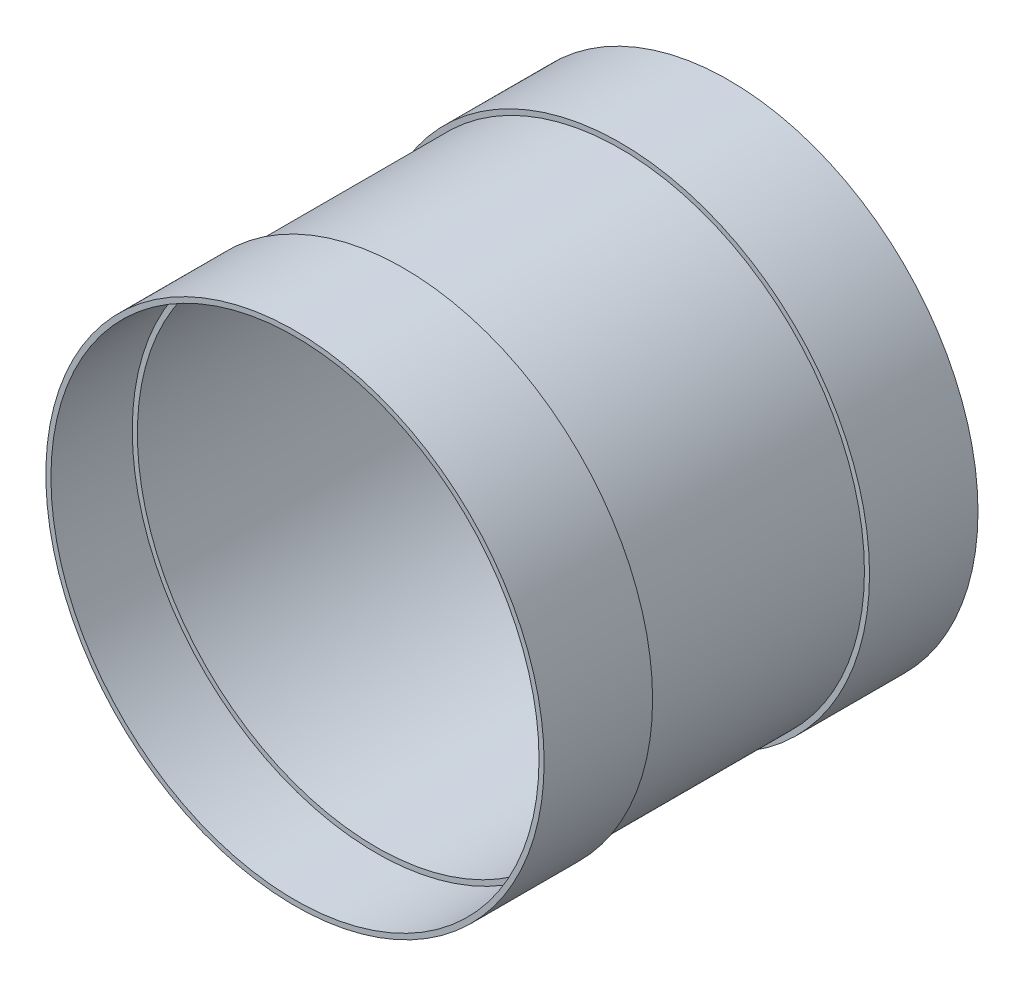
ISO-10303-21;
HEADER;
FILE_DESCRIPTION(('STEP AP214'),'2;1');
FILE_NAME('part.step','',(''),(''),'','','');
FILE_SCHEMA(('AUTOMOTIVE_DESIGN { 1 0 10303 214 1 1 1 1 }'));
ENDSEC;
DATA;
#1=APPLICATION_CONTEXT('core data for automotive mechanical design processes');
#2=APPLICATION_PROTOCOL_DEFINITION('international standard','automotive_design',2000,#1);
#3=PRODUCT_CONTEXT('',#1,'mechanical');
#4=PRODUCT('Part','Part','',(#3));
#5=PRODUCT_RELATED_PRODUCT_CATEGORY('part','',(#4));
#6=PRODUCT_DEFINITION_FORMATION('','',#4);
#7=PRODUCT_DEFINITION_CONTEXT('part definition',#1,'design');
#8=PRODUCT_DEFINITION('design','',#6,#7);
#9=PRODUCT_DEFINITION_SHAPE('','',#8);
#10=(LENGTH_UNIT() NAMED_UNIT(*) SI_UNIT(.MILLI.,.METRE.));
#11=(NAMED_UNIT(*) PLANE_ANGLE_UNIT() SI_UNIT($,.RADIAN.));
#12=(NAMED_UNIT(*) SI_UNIT($,.STERADIAN.) SOLID_ANGLE_UNIT());
#13=UNCERTAINTY_MEASURE_WITH_UNIT(LENGTH_MEASURE(1.E-05),#10,'distance_accuracy_value','');
#14=(GEOMETRIC_REPRESENTATION_CONTEXT(3) GLOBAL_UNCERTAINTY_ASSIGNED_CONTEXT((#13)) GLOBAL_UNIT_ASSIGNED_CONTEXT((#10,
#11,#12)) REPRESENTATION_CONTEXT('',''));
#15=CARTESIAN_POINT('',(0.,0.,0.));
#16=DIRECTION('',(0.,0.,1.));
#17=DIRECTION('',(1.,0.,0.));
#18=AXIS2_PLACEMENT_3D('',#15,#16,#17);
#19=CARTESIAN_POINT('',(0.,223.8375,127.));
#20=DIRECTION('',(0.,0.,-1.));
#21=DIRECTION('',(-1.,0.,0.));
#22=AXIS2_PLACEMENT_3D('',#19,#20,#21);
#23=PLANE('',#22);
#24=CARTESIAN_POINT('',(0.,0.,127.));
#25=DIRECTION('',(0.,0.,1.));
#26=DIRECTION('',(1.,0.,0.));
#27=AXIS2_PLACEMENT_3D('',#24,#25,#26);
#28=CIRCLE('',#27,223.8375);
#29=CARTESIAN_POINT('',(223.8375,0.,127.));
#30=VERTEX_POINT('',#29);
#31=EDGE_CURVE('E73',#30,#30,#28,.T.);
#32=ORIENTED_EDGE('',*,*,#31,.F.);
#33=EDGE_LOOP('',(#32));
#34=FACE_BOUND('',#33,.T.);
#35=CARTESIAN_POINT('',(0.,0.,127.));
#36=DIRECTION('',(0.,0.,1.));
#37=DIRECTION('',(1.,0.,0.));
#38=AXIS2_PLACEMENT_3D('',#35,#36,#37);
#39=CIRCLE('',#38,228.6);
#40=CARTESIAN_POINT('',(228.6,0.,127.));
#41=VERTEX_POINT('',#40);
#42=EDGE_CURVE('E11',#41,#41,#39,.T.);
#43=ORIENTED_EDGE('',*,*,#42,.T.);
#44=EDGE_LOOP('',(#43));
#45=FACE_BOUND('',#44,.T.);
#46=ADVANCED_FACE('F52',(#34,#45),#23,.F.);
#47=CARTESIAN_POINT('',(0.,0.,0.));
#48=DIRECTION('',(0.,0.,1.));
#49=DIRECTION('',(1.,0.,0.));
#50=AXIS2_PLACEMENT_3D('',#47,#48,#49);
#51=CYLINDRICAL_SURFACE('',#50,228.6);
#52=ORIENTED_EDGE('',*,*,#42,.F.);
#53=EDGE_LOOP('',(#52));
#54=FACE_BOUND('',#53,.T.);
#55=CARTESIAN_POINT('',(0.,0.,-127.));
#56=DIRECTION('',(0.,0.,1.));
#57=DIRECTION('',(1.,0.,0.));
#58=AXIS2_PLACEMENT_3D('',#55,#56,#57);
#59=CIRCLE('',#58,228.6);
#60=CARTESIAN_POINT('',(228.6,0.,-127.));
#61=VERTEX_POINT('',#60);
#62=EDGE_CURVE('E59',#61,#61,#59,.T.);
#63=ORIENTED_EDGE('',*,*,#62,.T.);
#64=EDGE_LOOP('',(#63));
#65=FACE_BOUND('',#64,.T.);
#66=ADVANCED_FACE('F85',(#54,#65),#51,.T.);
#67=CARTESIAN_POINT('',(0.,223.8375,-127.));
#68=DIRECTION('',(0.,0.,1.));
#69=DIRECTION('',(1.,0.,0.));
#70=AXIS2_PLACEMENT_3D('',#67,#68,#69);
#71=PLANE('',#70);
#72=ORIENTED_EDGE('',*,*,#62,.F.);
#73=EDGE_LOOP('',(#72));
#74=FACE_BOUND('',#73,.T.);
#75=CARTESIAN_POINT('',(0.,0.,-127.));
#76=DIRECTION('',(0.,0.,1.));
#77=DIRECTION('',(1.,0.,0.));
#78=AXIS2_PLACEMENT_3D('',#75,#76,#77);
#79=CIRCLE('',#78,223.8375);
#80=CARTESIAN_POINT('',(223.8375,0.,-127.));
#81=VERTEX_POINT('',#80);
#82=EDGE_CURVE('E66',#81,#81,#79,.T.);
#83=ORIENTED_EDGE('',*,*,#82,.T.);
#84=EDGE_LOOP('',(#83));
#85=FACE_BOUND('',#84,.T.);
#86=ADVANCED_FACE('F89',(#74,#85),#71,.F.);
#87=CARTESIAN_POINT('',(0.,0.,0.));
#88=DIRECTION('',(0.,0.,1.));
#89=DIRECTION('',(1.,0.,0.));
#90=AXIS2_PLACEMENT_3D('',#87,#88,#89);
#91=CYLINDRICAL_SURFACE('',#90,223.8375);
#92=ORIENTED_EDGE('',*,*,#82,.F.);
#93=EDGE_LOOP('',(#92));
#94=FACE_BOUND('',#93,.T.);
#95=ORIENTED_EDGE('',*,*,#31,.T.);
#96=EDGE_LOOP('',(#95));
#97=FACE_BOUND('',#96,.T.);
#98=ADVANCED_FACE('F82',(#94,#97),#91,.F.);
#99=CLOSED_SHELL('',(#46,#66,#86,#98));
#100=MANIFOLD_SOLID_BREP('B2',#99);
#101=CARTESIAN_POINT('',(0.,233.3625,-101.6));
#102=DIRECTION('',(0.,0.,-1.));
#103=DIRECTION('',(-1.,0.,0.));
#104=AXIS2_PLACEMENT_3D('',#101,#102,#103);
#105=PLANE('',#104);
#106=CARTESIAN_POINT('',(0.,0.,-101.6));
#107=DIRECTION('',(0.,0.,1.));
#108=DIRECTION('',(1.,0.,0.));
#109=AXIS2_PLACEMENT_3D('',#106,#107,#108);
#110=CIRCLE('',#109,228.6);
#111=CARTESIAN_POINT('',(228.6,0.,-101.6));
#112=VERTEX_POINT('',#111);
#113=EDGE_CURVE('E51',#112,#112,#110,.T.);
#114=ORIENTED_EDGE('',*,*,#113,.F.);
#115=EDGE_LOOP('',(#114));
#116=FACE_BOUND('',#115,.T.);
#117=CARTESIAN_POINT('',(0.,0.,-101.6));
#118=DIRECTION('',(0.,0.,1.));
#119=DIRECTION('',(1.,0.,0.));
#120=AXIS2_PLACEMENT_3D('',#117,#118,#119);
#121=CIRCLE('',#120,233.3625);
#122=CARTESIAN_POINT('',(233.3625,0.,-101.6));
#123=VERTEX_POINT('',#122);
#124=EDGE_CURVE('E160',#123,#123,#121,.T.);
#125=ORIENTED_EDGE('',*,*,#124,.T.);
#126=EDGE_LOOP('',(#125));
#127=FACE_BOUND('',#126,.T.);
#128=ADVANCED_FACE('F141',(#116,#127),#105,.F.);
#129=CARTESIAN_POINT('',(0.,0.,62.5945817490495));
#130=DIRECTION('',(0.,0.,1.));
#131=DIRECTION('',(1.,0.,0.));
#132=AXIS2_PLACEMENT_3D('',#129,#130,#131);
#133=CYLINDRICAL_SURFACE('',#132,228.6);
#134=CARTESIAN_POINT('',(0.,0.,-203.2));
#135=DIRECTION('',(0.,0.,1.));
#136=DIRECTION('',(1.,0.,0.));
#137=AXIS2_PLACEMENT_3D('',#134,#135,#136);
#138=CIRCLE('',#137,228.6);
#139=CARTESIAN_POINT('',(228.6,0.,-203.2));
#140=VERTEX_POINT('',#139);
#141=EDGE_CURVE('E148',#140,#140,#138,.T.);
#142=ORIENTED_EDGE('',*,*,#141,.F.);
#143=EDGE_LOOP('',(#142));
#144=FACE_BOUND('',#143,.T.);
#145=ORIENTED_EDGE('',*,*,#113,.T.);
#146=EDGE_LOOP('',(#145));
#147=FACE_BOUND('',#146,.T.);
#148=ADVANCED_FACE('F177',(#144,#147),#133,.F.);
#149=CARTESIAN_POINT('',(0.,233.3625,-203.2));
#150=DIRECTION('',(0.,0.,1.));
#151=DIRECTION('',(1.,0.,0.));
#152=AXIS2_PLACEMENT_3D('',#149,#150,#151);
#153=PLANE('',#152);
#154=CARTESIAN_POINT('',(0.,0.,-203.2));
#155=DIRECTION('',(0.,0.,1.));
#156=DIRECTION('',(1.,0.,0.));
#157=AXIS2_PLACEMENT_3D('',#154,#155,#156);
#158=CIRCLE('',#157,233.3625);
#159=CARTESIAN_POINT('',(233.3625,0.,-203.2));
#160=VERTEX_POINT('',#159);
#161=EDGE_CURVE('E154',#160,#160,#158,.T.);
#162=ORIENTED_EDGE('',*,*,#161,.F.);
#163=EDGE_LOOP('',(#162));
#164=FACE_BOUND('',#163,.T.);
#165=ORIENTED_EDGE('',*,*,#141,.T.);
#166=EDGE_LOOP('',(#165));
#167=FACE_BOUND('',#166,.T.);
#168=ADVANCED_FACE('F172',(#164,#167),#153,.F.);
#169=CARTESIAN_POINT('',(0.,0.,62.5945817490495));
#170=DIRECTION('',(0.,0.,1.));
#171=DIRECTION('',(1.,0.,0.));
#172=AXIS2_PLACEMENT_3D('',#169,#170,#171);
#173=CYLINDRICAL_SURFACE('',#172,233.3625);
#174=ORIENTED_EDGE('',*,*,#124,.F.);
#175=EDGE_LOOP('',(#174));
#176=FACE_BOUND('',#175,.T.);
#177=ORIENTED_EDGE('',*,*,#161,.T.);
#178=EDGE_LOOP('',(#177));
#179=FACE_BOUND('',#178,.T.);
#180=ADVANCED_FACE('F169',(#176,#179),#173,.T.);
#181=CLOSED_SHELL('',(#128,#148,#168,#180));
#182=MANIFOLD_SOLID_BREP('B6',#181);
#183=CARTESIAN_POINT('',(0.,228.6,203.2));
#184=DIRECTION('',(0.,0.,-1.));
#185=DIRECTION('',(-1.,0.,0.));
#186=AXIS2_PLACEMENT_3D('',#183,#184,#185);
#187=PLANE('',#186);
#188=CARTESIAN_POINT('',(0.,0.,203.2));
#189=DIRECTION('',(0.,0.,1.));
#190=DIRECTION('',(1.,0.,0.));
#191=AXIS2_PLACEMENT_3D('',#188,#189,#190);
#192=CIRCLE('',#191,228.6);
#193=CARTESIAN_POINT('',(228.6,0.,203.2));
#194=VERTEX_POINT('',#193);
#195=EDGE_CURVE('E238',#194,#194,#192,.T.);
#196=ORIENTED_EDGE('',*,*,#195,.F.);
#197=EDGE_LOOP('',(#196));
#198=FACE_BOUND('',#197,.T.);
#199=CARTESIAN_POINT('',(0.,0.,203.2));
#200=DIRECTION('',(0.,0.,1.));
#201=DIRECTION('',(1.,0.,0.));
#202=AXIS2_PLACEMENT_3D('',#199,#200,#201);
#203=CIRCLE('',#202,233.3625);
#204=CARTESIAN_POINT('',(233.3625,0.,203.2));
#205=VERTEX_POINT('',#204);
#206=EDGE_CURVE('E140',#205,#205,#203,.T.);
#207=ORIENTED_EDGE('',*,*,#206,.T.);
#208=EDGE_LOOP('',(#207));
#209=FACE_BOUND('',#208,.T.);
#210=ADVANCED_FACE('F219',(#198,#209),#187,.F.);
#211=CARTESIAN_POINT('',(0.,0.,62.5945817490495));
#212=DIRECTION('',(0.,0.,1.));
#213=DIRECTION('',(1.,0.,0.));
#214=AXIS2_PLACEMENT_3D('',#211,#212,#213);
#215=CYLINDRICAL_SURFACE('',#214,233.3625);
#216=ORIENTED_EDGE('',*,*,#206,.F.);
#217=EDGE_LOOP('',(#216));
#218=FACE_BOUND('',#217,.T.);
#219=CARTESIAN_POINT('',(0.,0.,101.6));
#220=DIRECTION('',(0.,0.,1.));
#221=DIRECTION('',(1.,0.,0.));
#222=AXIS2_PLACEMENT_3D('',#219,#220,#221);
#223=CIRCLE('',#222,233.3625);
#224=CARTESIAN_POINT('',(233.3625,0.,101.6));
#225=VERTEX_POINT('',#224);
#226=EDGE_CURVE('E226',#225,#225,#223,.T.);
#227=ORIENTED_EDGE('',*,*,#226,.T.);
#228=EDGE_LOOP('',(#227));
#229=FACE_BOUND('',#228,.T.);
#230=ADVANCED_FACE('F249',(#218,#229),#215,.T.);
#231=CARTESIAN_POINT('',(0.,233.3625,101.6));
#232=DIRECTION('',(0.,0.,1.));
#233=DIRECTION('',(1.,0.,0.));
#234=AXIS2_PLACEMENT_3D('',#231,#232,#233);
#235=PLANE('',#234);
#236=ORIENTED_EDGE('',*,*,#226,.F.);
#237=EDGE_LOOP('',(#236));
#238=FACE_BOUND('',#237,.T.);
#239=CARTESIAN_POINT('',(0.,0.,101.6));
#240=DIRECTION('',(0.,0.,1.));
#241=DIRECTION('',(1.,0.,0.));
#242=AXIS2_PLACEMENT_3D('',#239,#240,#241);
#243=CIRCLE('',#242,228.6);
#244=CARTESIAN_POINT('',(228.6,0.,101.6));
#245=VERTEX_POINT('',#244);
#246=EDGE_CURVE('E232',#245,#245,#243,.T.);
#247=ORIENTED_EDGE('',*,*,#246,.T.);
#248=EDGE_LOOP('',(#247));
#249=FACE_BOUND('',#248,.T.);
#250=ADVANCED_FACE('F253',(#238,#249),#235,.F.);
#251=CARTESIAN_POINT('',(0.,0.,62.5945817490495));
#252=DIRECTION('',(0.,0.,1.));
#253=DIRECTION('',(1.,0.,0.));
#254=AXIS2_PLACEMENT_3D('',#251,#252,#253);
#255=CYLINDRICAL_SURFACE('',#254,228.6);
#256=ORIENTED_EDGE('',*,*,#246,.F.);
#257=EDGE_LOOP('',(#256));
#258=FACE_BOUND('',#257,.T.);
#259=ORIENTED_EDGE('',*,*,#195,.T.);
#260=EDGE_LOOP('',(#259));
#261=FACE_BOUND('',#260,.T.);
#262=ADVANCED_FACE('F246',(#258,#261),#255,.F.);
#263=CLOSED_SHELL('',(#210,#230,#250,#262));
#264=MANIFOLD_SOLID_BREP('B46',#263);
#265=ADVANCED_BREP_SHAPE_REPRESENTATION('',(#18,#100,#182,#264),#14);
#266=SHAPE_DEFINITION_REPRESENTATION(#9,#265);
ENDSEC;
END-ISO-10303-21;
